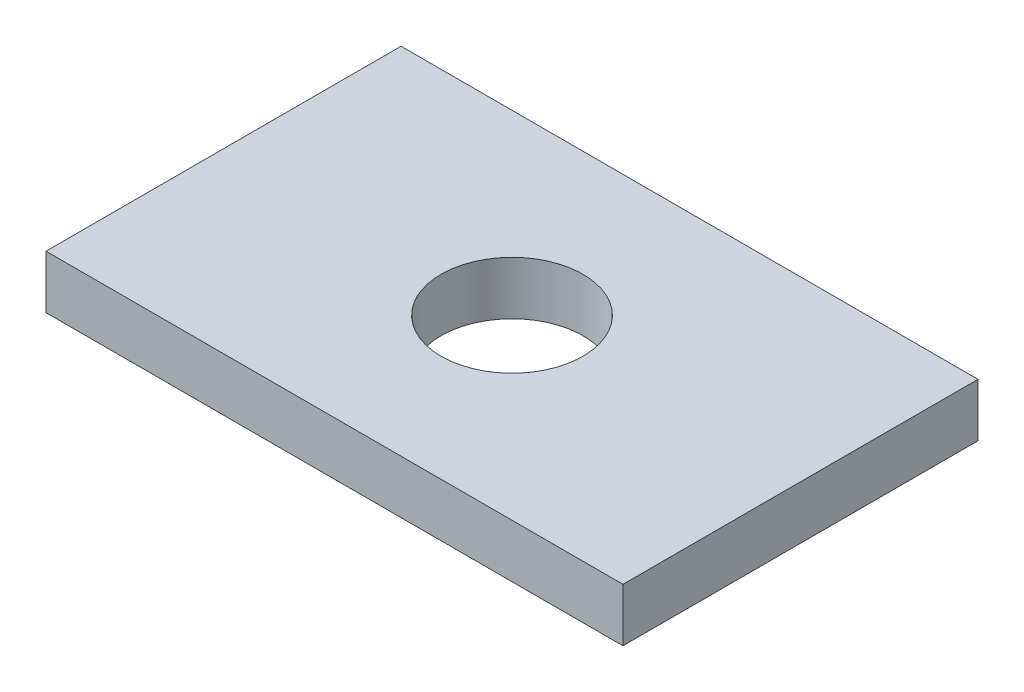
ISO-10303-21;
HEADER;
FILE_DESCRIPTION(('STEP AP214'),'2;1');
FILE_NAME('part.step','',(''),(''),'','','');
FILE_SCHEMA(('AUTOMOTIVE_DESIGN { 1 0 10303 214 1 1 1 1 }'));
ENDSEC;
DATA;
#1=APPLICATION_CONTEXT('core data for automotive mechanical design processes');
#2=APPLICATION_PROTOCOL_DEFINITION('international standard','automotive_design',2000,#1);
#3=PRODUCT_CONTEXT('',#1,'mechanical');
#4=PRODUCT('Part','Part','',(#3));
#5=PRODUCT_RELATED_PRODUCT_CATEGORY('part','',(#4));
#6=PRODUCT_DEFINITION_FORMATION('','',#4);
#7=PRODUCT_DEFINITION_CONTEXT('part definition',#1,'design');
#8=PRODUCT_DEFINITION('design','',#6,#7);
#9=PRODUCT_DEFINITION_SHAPE('','',#8);
#10=(LENGTH_UNIT() NAMED_UNIT(*) SI_UNIT(.MILLI.,.METRE.));
#11=(NAMED_UNIT(*) PLANE_ANGLE_UNIT() SI_UNIT($,.RADIAN.));
#12=(NAMED_UNIT(*) SI_UNIT($,.STERADIAN.) SOLID_ANGLE_UNIT());
#13=UNCERTAINTY_MEASURE_WITH_UNIT(LENGTH_MEASURE(1.E-05),#10,'distance_accuracy_value','');
#14=(GEOMETRIC_REPRESENTATION_CONTEXT(3) GLOBAL_UNCERTAINTY_ASSIGNED_CONTEXT((#13)) GLOBAL_UNIT_ASSIGNED_CONTEXT((#10,
#11,#12)) REPRESENTATION_CONTEXT('',''));
#15=CARTESIAN_POINT('',(0.,0.,0.));
#16=DIRECTION('',(0.,0.,1.));
#17=DIRECTION('',(1.,0.,0.));
#18=AXIS2_PLACEMENT_3D('',#15,#16,#17);
#19=CARTESIAN_POINT('',(32.5,-3.,40.));
#20=DIRECTION('',(-1.,0.,0.));
#21=DIRECTION('',(0.,0.,1.));
#22=AXIS2_PLACEMENT_3D('',#19,#20,#21);
#23=PLANE('',#22);
#24=DIRECTION('',(0.,1.,0.));
#25=VECTOR('',#24,1.);
#26=CARTESIAN_POINT('',(32.5,-3.,0.));
#27=LINE('',#26,#25);
#28=CARTESIAN_POINT('',(32.5,-3.,0.));
#29=VERTEX_POINT('',#28);
#30=CARTESIAN_POINT('',(32.5,3.,0.));
#31=VERTEX_POINT('',#30);
#32=EDGE_CURVE('E96',#29,#31,#27,.T.);
#33=ORIENTED_EDGE('',*,*,#32,.T.);
#34=DIRECTION('',(0.,0.,-1.));
#35=VECTOR('',#34,1.);
#36=CARTESIAN_POINT('',(32.5,3.,40.));
#37=LINE('',#36,#35);
#38=CARTESIAN_POINT('',(32.5,3.,40.));
#39=VERTEX_POINT('',#38);
#40=EDGE_CURVE('E11',#39,#31,#37,.T.);
#41=ORIENTED_EDGE('',*,*,#40,.F.);
#42=DIRECTION('',(0.,1.,0.));
#43=VECTOR('',#42,1.);
#44=CARTESIAN_POINT('',(32.5,-3.,40.));
#45=LINE('',#44,#43);
#46=CARTESIAN_POINT('',(32.5,-3.,40.));
#47=VERTEX_POINT('',#46);
#48=EDGE_CURVE('E84',#47,#39,#45,.T.);
#49=ORIENTED_EDGE('',*,*,#48,.F.);
#50=DIRECTION('',(0.,0.,-1.));
#51=VECTOR('',#50,1.);
#52=CARTESIAN_POINT('',(32.5,-3.,40.));
#53=LINE('',#52,#51);
#54=EDGE_CURVE('E92',#47,#29,#53,.T.);
#55=ORIENTED_EDGE('',*,*,#54,.T.);
#56=EDGE_LOOP('',(#33,#41,#49,#55));
#57=FACE_BOUND('',#56,.T.);
#58=ADVANCED_FACE('F33',(#57),#23,.F.);
#59=CARTESIAN_POINT('',(-32.5,3.,40.));
#60=DIRECTION('',(0.,-1.,0.));
#61=DIRECTION('',(0.,0.,-1.));
#62=AXIS2_PLACEMENT_3D('',#59,#60,#61);
#63=PLANE('',#62);
#64=CARTESIAN_POINT('',(0.,3.,20.));
#65=DIRECTION('',(0.,1.,0.));
#66=DIRECTION('',(0.,0.,1.));
#67=AXIS2_PLACEMENT_3D('',#64,#65,#66);
#68=CIRCLE('',#67,8.);
#69=CARTESIAN_POINT('',(0.,3.,28.));
#70=VERTEX_POINT('',#69);
#71=EDGE_CURVE('E110',#70,#70,#68,.T.);
#72=ORIENTED_EDGE('',*,*,#71,.F.);
#73=EDGE_LOOP('',(#72));
#74=FACE_BOUND('',#73,.T.);
#75=DIRECTION('',(-1.,0.,0.));
#76=VECTOR('',#75,1.);
#77=CARTESIAN_POINT('',(-32.5,3.,0.));
#78=LINE('',#77,#76);
#79=CARTESIAN_POINT('',(-32.5,3.,0.));
#80=VERTEX_POINT('',#79);
#81=EDGE_CURVE('E88',#31,#80,#78,.T.);
#82=ORIENTED_EDGE('',*,*,#81,.T.);
#83=DIRECTION('',(0.,0.,-1.));
#84=VECTOR('',#83,1.);
#85=CARTESIAN_POINT('',(-32.5,3.,40.));
#86=LINE('',#85,#84);
#87=CARTESIAN_POINT('',(-32.5,3.,40.));
#88=VERTEX_POINT('',#87);
#89=EDGE_CURVE('E41',#88,#80,#86,.T.);
#90=ORIENTED_EDGE('',*,*,#89,.F.);
#91=DIRECTION('',(-1.,0.,0.));
#92=VECTOR('',#91,1.);
#93=CARTESIAN_POINT('',(-32.5,3.,40.));
#94=LINE('',#93,#92);
#95=EDGE_CURVE('E79',#39,#88,#94,.T.);
#96=ORIENTED_EDGE('',*,*,#95,.F.);
#97=ORIENTED_EDGE('',*,*,#40,.T.);
#98=EDGE_LOOP('',(#82,#90,#96,#97));
#99=FACE_BOUND('',#98,.T.);
#100=ADVANCED_FACE('F87',(#74,#99),#63,.F.);
#101=CARTESIAN_POINT('',(-32.5,-3.,40.));
#102=DIRECTION('',(1.,0.,0.));
#103=DIRECTION('',(0.,0.,-1.));
#104=AXIS2_PLACEMENT_3D('',#101,#102,#103);
#105=PLANE('',#104);
#106=DIRECTION('',(0.,-1.,0.));
#107=VECTOR('',#106,1.);
#108=CARTESIAN_POINT('',(-32.5,-3.,0.));
#109=LINE('',#108,#107);
#110=CARTESIAN_POINT('',(-32.5,-3.,0.));
#111=VERTEX_POINT('',#110);
#112=EDGE_CURVE('E66',#80,#111,#109,.T.);
#113=ORIENTED_EDGE('',*,*,#112,.T.);
#114=DIRECTION('',(0.,0.,-1.));
#115=VECTOR('',#114,1.);
#116=CARTESIAN_POINT('',(-32.5,-3.,40.));
#117=LINE('',#116,#115);
#118=CARTESIAN_POINT('',(-32.5,-3.,40.));
#119=VERTEX_POINT('',#118);
#120=EDGE_CURVE('E89',#119,#111,#117,.T.);
#121=ORIENTED_EDGE('',*,*,#120,.F.);
#122=DIRECTION('',(0.,-1.,0.));
#123=VECTOR('',#122,1.);
#124=CARTESIAN_POINT('',(-32.5,-3.,40.));
#125=LINE('',#124,#123);
#126=EDGE_CURVE('E82',#88,#119,#125,.T.);
#127=ORIENTED_EDGE('',*,*,#126,.F.);
#128=ORIENTED_EDGE('',*,*,#89,.T.);
#129=EDGE_LOOP('',(#113,#121,#127,#128));
#130=FACE_BOUND('',#129,.T.);
#131=ADVANCED_FACE('F90',(#130),#105,.F.);
#132=CARTESIAN_POINT('',(-32.5,-3.,40.));
#133=DIRECTION('',(0.,1.,0.));
#134=DIRECTION('',(0.,0.,1.));
#135=AXIS2_PLACEMENT_3D('',#132,#133,#134);
#136=PLANE('',#135);
#137=CARTESIAN_POINT('',(0.,-3.,20.));
#138=DIRECTION('',(0.,1.,0.));
#139=DIRECTION('',(0.,0.,1.));
#140=AXIS2_PLACEMENT_3D('',#137,#138,#139);
#141=CIRCLE('',#140,8.);
#142=CARTESIAN_POINT('',(0.,-3.,28.));
#143=VERTEX_POINT('',#142);
#144=EDGE_CURVE('E99',#143,#143,#141,.T.);
#145=ORIENTED_EDGE('',*,*,#144,.T.);
#146=EDGE_LOOP('',(#145));
#147=FACE_BOUND('',#146,.T.);
#148=DIRECTION('',(1.,0.,0.));
#149=VECTOR('',#148,1.);
#150=CARTESIAN_POINT('',(-32.5,-3.,0.));
#151=LINE('',#150,#149);
#152=EDGE_CURVE('E72',#111,#29,#151,.T.);
#153=ORIENTED_EDGE('',*,*,#152,.T.);
#154=ORIENTED_EDGE('',*,*,#54,.F.);
#155=DIRECTION('',(1.,0.,0.));
#156=VECTOR('',#155,1.);
#157=CARTESIAN_POINT('',(-32.5,-3.,40.));
#158=LINE('',#157,#156);
#159=EDGE_CURVE('E49',#119,#47,#158,.T.);
#160=ORIENTED_EDGE('',*,*,#159,.F.);
#161=ORIENTED_EDGE('',*,*,#120,.T.);
#162=EDGE_LOOP('',(#153,#154,#160,#161));
#163=FACE_BOUND('',#162,.T.);
#164=ADVANCED_FACE('F104',(#147,#163),#136,.F.);
#165=CARTESIAN_POINT('',(0.,0.,40.));
#166=DIRECTION('',(0.,0.,-1.));
#167=DIRECTION('',(-1.,0.,0.));
#168=AXIS2_PLACEMENT_3D('',#165,#166,#167);
#169=PLANE('',#168);
#170=ORIENTED_EDGE('',*,*,#48,.T.);
#171=ORIENTED_EDGE('',*,*,#95,.T.);
#172=ORIENTED_EDGE('',*,*,#126,.T.);
#173=ORIENTED_EDGE('',*,*,#159,.T.);
#174=EDGE_LOOP('',(#170,#171,#172,#173));
#175=FACE_BOUND('',#174,.T.);
#176=ADVANCED_FACE('F80',(#175),#169,.F.);
#177=CARTESIAN_POINT('',(0.,0.,0.));
#178=DIRECTION('',(0.,0.,-1.));
#179=DIRECTION('',(-1.,0.,0.));
#180=AXIS2_PLACEMENT_3D('',#177,#178,#179);
#181=PLANE('',#180);
#182=ORIENTED_EDGE('',*,*,#32,.F.);
#183=ORIENTED_EDGE('',*,*,#152,.F.);
#184=ORIENTED_EDGE('',*,*,#112,.F.);
#185=ORIENTED_EDGE('',*,*,#81,.F.);
#186=EDGE_LOOP('',(#182,#183,#184,#185));
#187=FACE_BOUND('',#186,.T.);
#188=ADVANCED_FACE('F107',(#187),#181,.T.);
#189=CARTESIAN_POINT('',(0.,-3.,20.));
#190=DIRECTION('',(0.,1.,0.));
#191=DIRECTION('',(0.,0.,1.));
#192=AXIS2_PLACEMENT_3D('',#189,#190,#191);
#193=CYLINDRICAL_SURFACE('',#192,8.);
#194=ORIENTED_EDGE('',*,*,#144,.F.);
#195=EDGE_LOOP('',(#194));
#196=FACE_BOUND('',#195,.T.);
#197=ORIENTED_EDGE('',*,*,#71,.T.);
#198=EDGE_LOOP('',(#197));
#199=FACE_BOUND('',#198,.T.);
#200=ADVANCED_FACE('F117',(#196,#199),#193,.F.);
#201=CLOSED_SHELL('',(#58,#100,#131,#164,#176,#188,#200));
#202=MANIFOLD_SOLID_BREP('B2',#201);
#203=ADVANCED_BREP_SHAPE_REPRESENTATION('',(#18,#202),#14);
#204=SHAPE_DEFINITION_REPRESENTATION(#9,#203);
ENDSEC;
END-ISO-10303-21;
